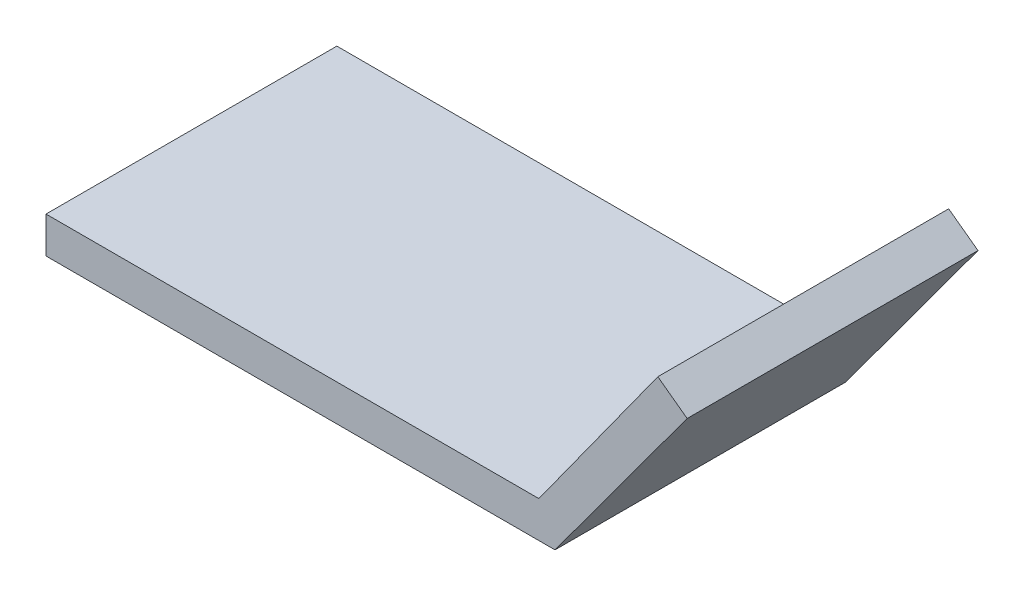
ISO-10303-21;
HEADER;
FILE_DESCRIPTION(('STEP AP214'),'2;1');
FILE_NAME('part.step','',(''),(''),'','','');
FILE_SCHEMA(('AUTOMOTIVE_DESIGN { 1 0 10303 214 1 1 1 1 }'));
ENDSEC;
DATA;
#1=APPLICATION_CONTEXT('core data for automotive mechanical design processes');
#2=APPLICATION_PROTOCOL_DEFINITION('international standard','automotive_design',2000,#1);
#3=PRODUCT_CONTEXT('',#1,'mechanical');
#4=PRODUCT('Part','Part','',(#3));
#5=PRODUCT_RELATED_PRODUCT_CATEGORY('part','',(#4));
#6=PRODUCT_DEFINITION_FORMATION('','',#4);
#7=PRODUCT_DEFINITION_CONTEXT('part definition',#1,'design');
#8=PRODUCT_DEFINITION('design','',#6,#7);
#9=PRODUCT_DEFINITION_SHAPE('','',#8);
#10=(LENGTH_UNIT() NAMED_UNIT(*) SI_UNIT(.MILLI.,.METRE.));
#11=(NAMED_UNIT(*) PLANE_ANGLE_UNIT() SI_UNIT($,.RADIAN.));
#12=(NAMED_UNIT(*) SI_UNIT($,.STERADIAN.) SOLID_ANGLE_UNIT());
#13=UNCERTAINTY_MEASURE_WITH_UNIT(LENGTH_MEASURE(1.E-05),#10,'distance_accuracy_value','');
#14=(GEOMETRIC_REPRESENTATION_CONTEXT(3) GLOBAL_UNCERTAINTY_ASSIGNED_CONTEXT((#13)) GLOBAL_UNIT_ASSIGNED_CONTEXT((#10,
#11,#12)) REPRESENTATION_CONTEXT('',''));
#15=CARTESIAN_POINT('',(0.,0.,0.));
#16=DIRECTION('',(0.,0.,1.));
#17=DIRECTION('',(1.,0.,0.));
#18=AXIS2_PLACEMENT_3D('',#15,#16,#17);
#19=CARTESIAN_POINT('',(11.5395474655866,15.7075924375975,25.4));
#20=DIRECTION('',(-0.805899549376415,0.592052291875381,0.));
#21=DIRECTION('',(-0.592052291875381,-0.805899549376415,0.));
#22=AXIS2_PLACEMENT_3D('',#19,#20,#21);
#23=PLANE('',#22);
#24=DIRECTION('',(0.592052291875381,0.805899549376415,0.));
#25=VECTOR('',#24,1.);
#26=CARTESIAN_POINT('',(11.5395474655866,15.7075924375975,0.));
#27=LINE('',#26,#25);
#28=CARTESIAN_POINT('',(0.,0.,0.));
#29=VERTEX_POINT('',#28);
#30=CARTESIAN_POINT('',(11.5395474655866,15.7075924375975,0.));
#31=VERTEX_POINT('',#30);
#32=EDGE_CURVE('E117',#29,#31,#27,.T.);
#33=ORIENTED_EDGE('',*,*,#32,.T.);
#34=DIRECTION('',(0.,0.,-1.));
#35=VECTOR('',#34,1.);
#36=CARTESIAN_POINT('',(11.5395474655866,15.7075924375975,25.4));
#37=LINE('',#36,#35);
#38=CARTESIAN_POINT('',(11.5395474655866,15.7075924375975,25.4));
#39=VERTEX_POINT('',#38);
#40=EDGE_CURVE('E11',#39,#31,#37,.T.);
#41=ORIENTED_EDGE('',*,*,#40,.F.);
#42=DIRECTION('',(0.592052291875381,0.805899549376415,0.));
#43=VECTOR('',#42,1.);
#44=CARTESIAN_POINT('',(11.5395474655866,15.7075924375975,25.4));
#45=LINE('',#44,#43);
#46=CARTESIAN_POINT('',(0.,0.,25.4));
#47=VERTEX_POINT('',#46);
#48=EDGE_CURVE('E127',#47,#39,#45,.T.);
#49=ORIENTED_EDGE('',*,*,#48,.F.);
#50=DIRECTION('',(0.,0.,-1.));
#51=VECTOR('',#50,1.);
#52=CARTESIAN_POINT('',(0.,0.,25.4));
#53=LINE('',#52,#51);
#54=EDGE_CURVE('E113',#47,#29,#53,.T.);
#55=ORIENTED_EDGE('',*,*,#54,.T.);
#56=EDGE_LOOP('',(#33,#41,#49,#55));
#57=FACE_BOUND('',#56,.T.);
#58=ADVANCED_FACE('F33',(#57),#23,.F.);
#59=CARTESIAN_POINT('',(8.9808163963165,17.5873584643019,25.4));
#60=DIRECTION('',(-0.59205229187538,-0.805899549376416,0.));
#61=DIRECTION('',(0.805899549376416,-0.59205229187538,0.));
#62=AXIS2_PLACEMENT_3D('',#59,#60,#61);
#63=PLANE('',#62);
#64=DIRECTION('',(-0.805899549376416,0.59205229187538,0.));
#65=VECTOR('',#64,1.);
#66=CARTESIAN_POINT('',(8.9808163963165,17.5873584643019,0.));
#67=LINE('',#66,#65);
#68=CARTESIAN_POINT('',(8.9808163963165,17.5873584643019,0.));
#69=VERTEX_POINT('',#68);
#70=EDGE_CURVE('E120',#31,#69,#67,.T.);
#71=ORIENTED_EDGE('',*,*,#70,.T.);
#72=DIRECTION('',(0.,0.,-1.));
#73=VECTOR('',#72,1.);
#74=CARTESIAN_POINT('',(8.9808163963165,17.5873584643019,25.4));
#75=LINE('',#74,#73);
#76=CARTESIAN_POINT('',(8.9808163963165,17.5873584643019,25.4));
#77=VERTEX_POINT('',#76);
#78=EDGE_CURVE('E41',#77,#69,#75,.T.);
#79=ORIENTED_EDGE('',*,*,#78,.F.);
#80=DIRECTION('',(-0.805899549376416,0.59205229187538,0.));
#81=VECTOR('',#80,1.);
#82=CARTESIAN_POINT('',(8.9808163963165,17.5873584643019,25.4));
#83=LINE('',#82,#81);
#84=EDGE_CURVE('E86',#39,#77,#83,.T.);
#85=ORIENTED_EDGE('',*,*,#84,.F.);
#86=ORIENTED_EDGE('',*,*,#40,.T.);
#87=EDGE_LOOP('',(#71,#79,#85,#86));
#88=FACE_BOUND('',#87,.T.);
#89=ADVANCED_FACE('F151',(#88),#63,.F.);
#90=CARTESIAN_POINT('',(-1.4080405964264,3.175,25.4));
#91=DIRECTION('',(0.811215038352243,-0.584747947026041,0.));
#92=DIRECTION('',(0.584747947026041,0.811215038352243,0.));
#93=AXIS2_PLACEMENT_3D('',#90,#91,#92);
#94=PLANE('',#93);
#95=DIRECTION('',(-0.584747947026041,-0.811215038352243,0.));
#96=VECTOR('',#95,1.);
#97=CARTESIAN_POINT('',(-1.4080405964264,3.175,0.));
#98=LINE('',#97,#96);
#99=CARTESIAN_POINT('',(-1.4080405964264,3.175,0.));
#100=VERTEX_POINT('',#99);
#101=EDGE_CURVE('E122',#69,#100,#98,.T.);
#102=ORIENTED_EDGE('',*,*,#101,.T.);
#103=DIRECTION('',(0.,0.,-1.));
#104=VECTOR('',#103,1.);
#105=CARTESIAN_POINT('',(-1.4080405964264,3.175,25.4));
#106=LINE('',#105,#104);
#107=CARTESIAN_POINT('',(-1.4080405964264,3.175,25.4));
#108=VERTEX_POINT('',#107);
#109=EDGE_CURVE('E108',#108,#100,#106,.T.);
#110=ORIENTED_EDGE('',*,*,#109,.F.);
#111=DIRECTION('',(-0.584747947026041,-0.811215038352243,0.));
#112=VECTOR('',#111,1.);
#113=CARTESIAN_POINT('',(-1.4080405964264,3.175,25.4));
#114=LINE('',#113,#112);
#115=EDGE_CURVE('E99',#77,#108,#114,.T.);
#116=ORIENTED_EDGE('',*,*,#115,.F.);
#117=ORIENTED_EDGE('',*,*,#78,.T.);
#118=EDGE_LOOP('',(#102,#110,#116,#117));
#119=FACE_BOUND('',#118,.T.);
#120=ADVANCED_FACE('F133',(#119),#94,.F.);
#121=CARTESIAN_POINT('',(-44.45,3.17499999999999,25.4));
#122=DIRECTION('',(0.,-1.,0.));
#123=DIRECTION('',(1.,0.,0.));
#124=AXIS2_PLACEMENT_3D('',#121,#122,#123);
#125=PLANE('',#124);
#126=DIRECTION('',(-1.,0.,0.));
#127=VECTOR('',#126,1.);
#128=CARTESIAN_POINT('',(-44.45,3.17499999999999,0.));
#129=LINE('',#128,#127);
#130=CARTESIAN_POINT('',(-44.45,3.17499999999999,0.));
#131=VERTEX_POINT('',#130);
#132=EDGE_CURVE('E107',#100,#131,#129,.T.);
#133=ORIENTED_EDGE('',*,*,#132,.T.);
#134=DIRECTION('',(0.,0.,-1.));
#135=VECTOR('',#134,1.);
#136=CARTESIAN_POINT('',(-44.45,3.17499999999999,25.4));
#137=LINE('',#136,#135);
#138=CARTESIAN_POINT('',(-44.45,3.17499999999999,25.4));
#139=VERTEX_POINT('',#138);
#140=EDGE_CURVE('E104',#139,#131,#137,.T.);
#141=ORIENTED_EDGE('',*,*,#140,.F.);
#142=DIRECTION('',(-1.,0.,0.));
#143=VECTOR('',#142,1.);
#144=CARTESIAN_POINT('',(-44.45,3.17499999999999,25.4));
#145=LINE('',#144,#143);
#146=EDGE_CURVE('E93',#108,#139,#145,.T.);
#147=ORIENTED_EDGE('',*,*,#146,.F.);
#148=ORIENTED_EDGE('',*,*,#109,.T.);
#149=EDGE_LOOP('',(#133,#141,#147,#148));
#150=FACE_BOUND('',#149,.T.);
#151=ADVANCED_FACE('F105',(#150),#125,.F.);
#152=CARTESIAN_POINT('',(-44.45,0.,25.4));
#153=DIRECTION('',(1.,0.,0.));
#154=DIRECTION('',(0.,0.,-1.));
#155=AXIS2_PLACEMENT_3D('',#152,#153,#154);
#156=PLANE('',#155);
#157=DIRECTION('',(0.,-1.,0.));
#158=VECTOR('',#157,1.);
#159=CARTESIAN_POINT('',(-44.45,0.,0.));
#160=LINE('',#159,#158);
#161=CARTESIAN_POINT('',(-44.45,0.,0.));
#162=VERTEX_POINT('',#161);
#163=EDGE_CURVE('E72',#131,#162,#160,.T.);
#164=ORIENTED_EDGE('',*,*,#163,.T.);
#165=DIRECTION('',(0.,0.,-1.));
#166=VECTOR('',#165,1.);
#167=CARTESIAN_POINT('',(-44.45,0.,25.4));
#168=LINE('',#167,#166);
#169=CARTESIAN_POINT('',(-44.45,0.,25.4));
#170=VERTEX_POINT('',#169);
#171=EDGE_CURVE('E109',#170,#162,#168,.T.);
#172=ORIENTED_EDGE('',*,*,#171,.F.);
#173=DIRECTION('',(0.,-1.,0.));
#174=VECTOR('',#173,1.);
#175=CARTESIAN_POINT('',(-44.45,0.,25.4));
#176=LINE('',#175,#174);
#177=EDGE_CURVE('E97',#139,#170,#176,.T.);
#178=ORIENTED_EDGE('',*,*,#177,.F.);
#179=ORIENTED_EDGE('',*,*,#140,.T.);
#180=EDGE_LOOP('',(#164,#172,#178,#179));
#181=FACE_BOUND('',#180,.T.);
#182=ADVANCED_FACE('F111',(#181),#156,.F.);
#183=CARTESIAN_POINT('',(0.,0.,25.4));
#184=DIRECTION('',(0.,1.,0.));
#185=DIRECTION('',(-1.,0.,0.));
#186=AXIS2_PLACEMENT_3D('',#183,#184,#185);
#187=PLANE('',#186);
#188=DIRECTION('',(1.,0.,0.));
#189=VECTOR('',#188,1.);
#190=CARTESIAN_POINT('',(0.,0.,0.));
#191=LINE('',#190,#189);
#192=EDGE_CURVE('E78',#162,#29,#191,.T.);
#193=ORIENTED_EDGE('',*,*,#192,.T.);
#194=ORIENTED_EDGE('',*,*,#54,.F.);
#195=DIRECTION('',(1.,0.,0.));
#196=VECTOR('',#195,1.);
#197=CARTESIAN_POINT('',(0.,0.,25.4));
#198=LINE('',#197,#196);
#199=EDGE_CURVE('E49',#170,#47,#198,.T.);
#200=ORIENTED_EDGE('',*,*,#199,.F.);
#201=ORIENTED_EDGE('',*,*,#171,.T.);
#202=EDGE_LOOP('',(#193,#194,#200,#201));
#203=FACE_BOUND('',#202,.T.);
#204=ADVANCED_FACE('F140',(#203),#187,.F.);
#205=CARTESIAN_POINT('',(0.,0.,25.4));
#206=DIRECTION('',(0.,0.,1.));
#207=DIRECTION('',(1.,0.,0.));
#208=AXIS2_PLACEMENT_3D('',#205,#206,#207);
#209=PLANE('',#208);
#210=ORIENTED_EDGE('',*,*,#48,.T.);
#211=ORIENTED_EDGE('',*,*,#84,.T.);
#212=ORIENTED_EDGE('',*,*,#115,.T.);
#213=ORIENTED_EDGE('',*,*,#146,.T.);
#214=ORIENTED_EDGE('',*,*,#177,.T.);
#215=ORIENTED_EDGE('',*,*,#199,.T.);
#216=EDGE_LOOP('',(#210,#211,#212,#213,#214,#215));
#217=FACE_BOUND('',#216,.T.);
#218=ADVANCED_FACE('F95',(#217),#209,.T.);
#219=CARTESIAN_POINT('',(0.,0.,0.));
#220=DIRECTION('',(0.,0.,1.));
#221=DIRECTION('',(1.,0.,0.));
#222=AXIS2_PLACEMENT_3D('',#219,#220,#221);
#223=PLANE('',#222);
#224=ORIENTED_EDGE('',*,*,#32,.F.);
#225=ORIENTED_EDGE('',*,*,#192,.F.);
#226=ORIENTED_EDGE('',*,*,#163,.F.);
#227=ORIENTED_EDGE('',*,*,#132,.F.);
#228=ORIENTED_EDGE('',*,*,#101,.F.);
#229=ORIENTED_EDGE('',*,*,#70,.F.);
#230=EDGE_LOOP('',(#224,#225,#226,#227,#228,#229));
#231=FACE_BOUND('',#230,.T.);
#232=ADVANCED_FACE('F136',(#231),#223,.F.);
#233=CLOSED_SHELL('',(#58,#89,#120,#151,#182,#204,#218,#232));
#234=MANIFOLD_SOLID_BREP('B2',#233);
#235=ADVANCED_BREP_SHAPE_REPRESENTATION('',(#18,#234),#14);
#236=SHAPE_DEFINITION_REPRESENTATION(#9,#235);
ENDSEC;
END-ISO-10303-21;
